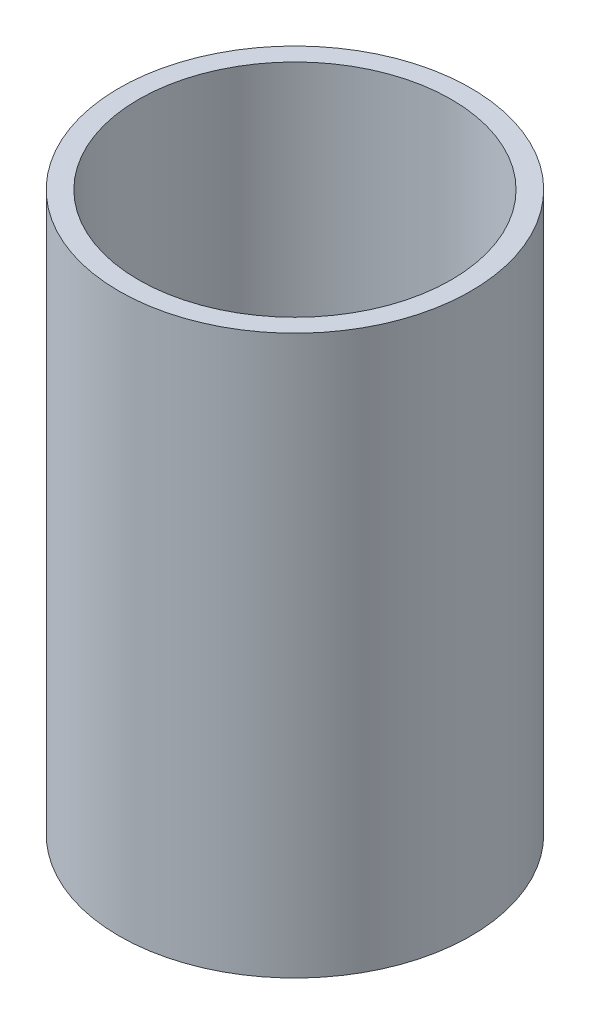
ISO-10303-21;
HEADER;
FILE_DESCRIPTION(('STEP AP214'),'2;1');
FILE_NAME('part.step','',(''),(''),'','','');
FILE_SCHEMA(('AUTOMOTIVE_DESIGN { 1 0 10303 214 1 1 1 1 }'));
ENDSEC;
DATA;
#1=APPLICATION_CONTEXT('core data for automotive mechanical design processes');
#2=APPLICATION_PROTOCOL_DEFINITION('international standard','automotive_design',2000,#1);
#3=PRODUCT_CONTEXT('',#1,'mechanical');
#4=PRODUCT('Part','Part','',(#3));
#5=PRODUCT_RELATED_PRODUCT_CATEGORY('part','',(#4));
#6=PRODUCT_DEFINITION_FORMATION('','',#4);
#7=PRODUCT_DEFINITION_CONTEXT('part definition',#1,'design');
#8=PRODUCT_DEFINITION('design','',#6,#7);
#9=PRODUCT_DEFINITION_SHAPE('','',#8);
#10=(LENGTH_UNIT() NAMED_UNIT(*) SI_UNIT(.MILLI.,.METRE.));
#11=(NAMED_UNIT(*) PLANE_ANGLE_UNIT() SI_UNIT($,.RADIAN.));
#12=(NAMED_UNIT(*) SI_UNIT($,.STERADIAN.) SOLID_ANGLE_UNIT());
#13=UNCERTAINTY_MEASURE_WITH_UNIT(LENGTH_MEASURE(1.E-05),#10,'distance_accuracy_value','');
#14=(GEOMETRIC_REPRESENTATION_CONTEXT(3) GLOBAL_UNCERTAINTY_ASSIGNED_CONTEXT((#13)) GLOBAL_UNIT_ASSIGNED_CONTEXT((#10,
#11,#12)) REPRESENTATION_CONTEXT('',''));
#15=CARTESIAN_POINT('',(0.,0.,0.));
#16=DIRECTION('',(0.,0.,1.));
#17=DIRECTION('',(1.,0.,0.));
#18=AXIS2_PLACEMENT_3D('',#15,#16,#17);
#19=CARTESIAN_POINT('',(0.,100.,0.));
#20=DIRECTION('',(0.,-1.,0.));
#21=DIRECTION('',(0.,0.,-1.));
#22=AXIS2_PLACEMENT_3D('',#19,#20,#21);
#23=CYLINDRICAL_SURFACE('',#22,31.5);
#24=CARTESIAN_POINT('',(0.,100.,0.));
#25=DIRECTION('',(0.,1.,0.));
#26=DIRECTION('',(0.,0.,1.));
#27=AXIS2_PLACEMENT_3D('',#24,#25,#26);
#28=CIRCLE('',#27,31.5);
#29=CARTESIAN_POINT('',(0.,100.,31.5));
#30=VERTEX_POINT('',#29);
#31=EDGE_CURVE('E10',#30,#30,#28,.T.);
#32=ORIENTED_EDGE('',*,*,#31,.F.);
#33=EDGE_LOOP('',(#32));
#34=FACE_BOUND('',#33,.T.);
#35=CARTESIAN_POINT('',(0.,0.,0.));
#36=DIRECTION('',(0.,1.,0.));
#37=DIRECTION('',(0.,0.,1.));
#38=AXIS2_PLACEMENT_3D('',#35,#36,#37);
#39=CIRCLE('',#38,31.5);
#40=CARTESIAN_POINT('',(0.,0.,31.5));
#41=VERTEX_POINT('',#40);
#42=EDGE_CURVE('E34',#41,#41,#39,.T.);
#43=ORIENTED_EDGE('',*,*,#42,.T.);
#44=EDGE_LOOP('',(#43));
#45=FACE_BOUND('',#44,.T.);
#46=ADVANCED_FACE('F31',(#34,#45),#23,.T.);
#47=CARTESIAN_POINT('',(0.,100.,0.));
#48=DIRECTION('',(0.,1.,0.));
#49=DIRECTION('',(0.,0.,1.));
#50=AXIS2_PLACEMENT_3D('',#47,#48,#49);
#51=PLANE('',#50);
#52=CARTESIAN_POINT('',(0.,100.,0.));
#53=DIRECTION('',(0.,1.,0.));
#54=DIRECTION('',(0.,0.,1.));
#55=AXIS2_PLACEMENT_3D('',#52,#53,#54);
#56=CIRCLE('',#55,28.);
#57=CARTESIAN_POINT('',(0.,100.,28.));
#58=VERTEX_POINT('',#57);
#59=EDGE_CURVE('E45',#58,#58,#56,.T.);
#60=ORIENTED_EDGE('',*,*,#59,.F.);
#61=EDGE_LOOP('',(#60));
#62=FACE_BOUND('',#61,.T.);
#63=ORIENTED_EDGE('',*,*,#31,.T.);
#64=EDGE_LOOP('',(#63));
#65=FACE_BOUND('',#64,.T.);
#66=ADVANCED_FACE('F52',(#62,#65),#51,.T.);
#67=CARTESIAN_POINT('',(0.,0.,0.));
#68=DIRECTION('',(0.,1.,0.));
#69=DIRECTION('',(0.,0.,1.));
#70=AXIS2_PLACEMENT_3D('',#67,#68,#69);
#71=PLANE('',#70);
#72=CARTESIAN_POINT('',(0.,0.,0.));
#73=DIRECTION('',(0.,1.,0.));
#74=DIRECTION('',(0.,0.,1.));
#75=AXIS2_PLACEMENT_3D('',#72,#73,#74);
#76=CIRCLE('',#75,28.);
#77=CARTESIAN_POINT('',(0.,0.,28.));
#78=VERTEX_POINT('',#77);
#79=EDGE_CURVE('E41',#78,#78,#76,.F.);
#80=ORIENTED_EDGE('',*,*,#79,.F.);
#81=EDGE_LOOP('',(#80));
#82=FACE_BOUND('',#81,.T.);
#83=ORIENTED_EDGE('',*,*,#42,.F.);
#84=EDGE_LOOP('',(#83));
#85=FACE_BOUND('',#84,.T.);
#86=ADVANCED_FACE('F54',(#82,#85),#71,.F.);
#87=CARTESIAN_POINT('',(0.,-0.001000000000001,0.));
#88=DIRECTION('',(0.,1.,0.));
#89=DIRECTION('',(0.,0.,1.));
#90=AXIS2_PLACEMENT_3D('',#87,#88,#89);
#91=CYLINDRICAL_SURFACE('',#90,28.);
#92=ORIENTED_EDGE('',*,*,#59,.T.);
#93=EDGE_LOOP('',(#92));
#94=FACE_BOUND('',#93,.T.);
#95=ORIENTED_EDGE('',*,*,#79,.T.);
#96=EDGE_LOOP('',(#95));
#97=FACE_BOUND('',#96,.T.);
#98=ADVANCED_FACE('F49',(#94,#97),#91,.F.);
#99=CLOSED_SHELL('',(#46,#66,#86,#98));
#100=MANIFOLD_SOLID_BREP('B2',#99);
#101=ADVANCED_BREP_SHAPE_REPRESENTATION('',(#18,#100),#14);
#102=SHAPE_DEFINITION_REPRESENTATION(#9,#101);
ENDSEC;
END-ISO-10303-21;
